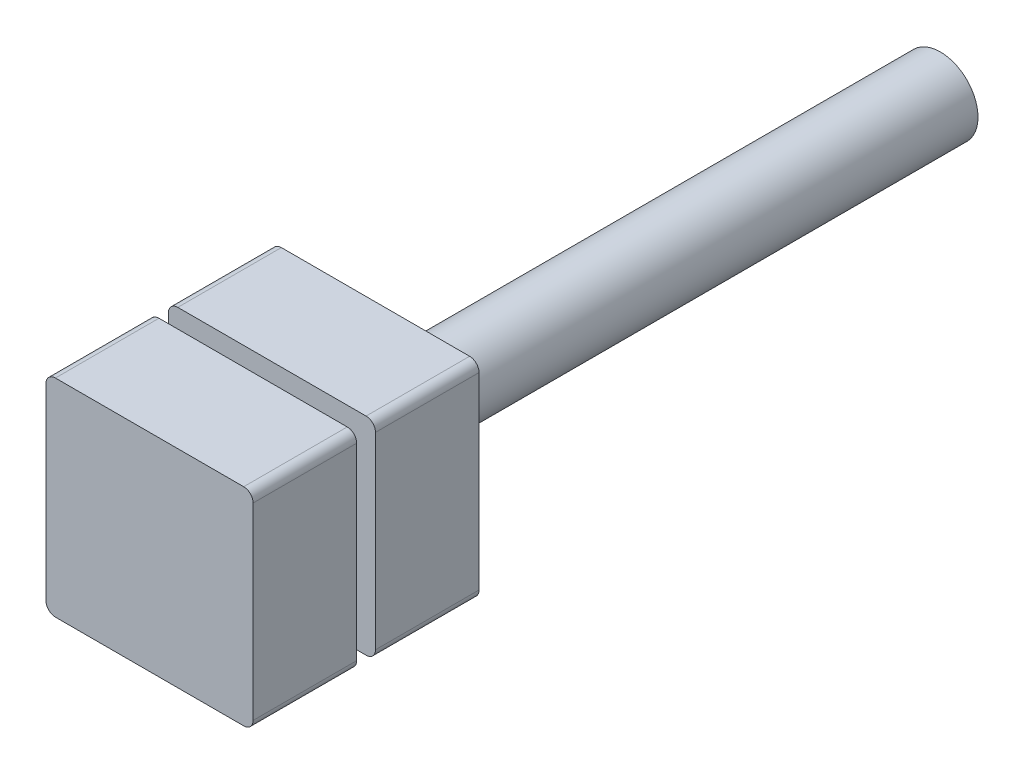
ISO-10303-21;
HEADER;
FILE_DESCRIPTION(('STEP AP214'),'2;1');
FILE_NAME('part.step','',(''),(''),'','','');
FILE_SCHEMA(('AUTOMOTIVE_DESIGN { 1 0 10303 214 1 1 1 1 }'));
ENDSEC;
DATA;
#1=APPLICATION_CONTEXT('core data for automotive mechanical design processes');
#2=APPLICATION_PROTOCOL_DEFINITION('international standard','automotive_design',2000,#1);
#3=PRODUCT_CONTEXT('',#1,'mechanical');
#4=PRODUCT('Part','Part','',(#3));
#5=PRODUCT_RELATED_PRODUCT_CATEGORY('part','',(#4));
#6=PRODUCT_DEFINITION_FORMATION('','',#4);
#7=PRODUCT_DEFINITION_CONTEXT('part definition',#1,'design');
#8=PRODUCT_DEFINITION('design','',#6,#7);
#9=PRODUCT_DEFINITION_SHAPE('','',#8);
#10=(LENGTH_UNIT() NAMED_UNIT(*) SI_UNIT(.MILLI.,.METRE.));
#11=(NAMED_UNIT(*) PLANE_ANGLE_UNIT() SI_UNIT($,.RADIAN.));
#12=(NAMED_UNIT(*) SI_UNIT($,.STERADIAN.) SOLID_ANGLE_UNIT());
#13=UNCERTAINTY_MEASURE_WITH_UNIT(LENGTH_MEASURE(1.E-05),#10,'distance_accuracy_value','');
#14=(GEOMETRIC_REPRESENTATION_CONTEXT(3) GLOBAL_UNCERTAINTY_ASSIGNED_CONTEXT((#13)) GLOBAL_UNIT_ASSIGNED_CONTEXT((#10,
#11,#12)) REPRESENTATION_CONTEXT('',''));
#15=CARTESIAN_POINT('',(0.,0.,0.));
#16=DIRECTION('',(0.,0.,1.));
#17=DIRECTION('',(1.,0.,0.));
#18=AXIS2_PLACEMENT_3D('',#15,#16,#17);
#19=CARTESIAN_POINT('',(-11.,11.,24.));
#20=DIRECTION('',(0.,-1.,0.));
#21=DIRECTION('',(0.,0.,-1.));
#22=AXIS2_PLACEMENT_3D('',#19,#20,#21);
#23=PLANE('',#22);
#24=DIRECTION('',(-1.,0.,0.));
#25=VECTOR('',#24,1.);
#26=CARTESIAN_POINT('',(-11.,11.,0.));
#27=LINE('',#26,#25);
#28=CARTESIAN_POINT('',(10.,11.,0.));
#29=VERTEX_POINT('',#28);
#30=CARTESIAN_POINT('',(-10.,11.,0.));
#31=VERTEX_POINT('',#30);
#32=EDGE_CURVE('E282',#29,#31,#27,.T.);
#33=ORIENTED_EDGE('',*,*,#32,.T.);
#34=DIRECTION('',(0.,0.,-1.));
#35=VECTOR('',#34,1.);
#36=CARTESIAN_POINT('',(-10.,11.,24.));
#37=LINE('',#36,#35);
#38=CARTESIAN_POINT('',(-10.,11.,11.));
#39=VERTEX_POINT('',#38);
#40=EDGE_CURVE('E378',#31,#39,#37,.F.);
#41=ORIENTED_EDGE('',*,*,#40,.T.);
#42=DIRECTION('',(1.,0.,0.));
#43=VECTOR('',#42,1.);
#44=CARTESIAN_POINT('',(8.,11.,11.));
#45=LINE('',#44,#43);
#46=CARTESIAN_POINT('',(10.,11.,11.));
#47=VERTEX_POINT('',#46);
#48=EDGE_CURVE('E241',#39,#47,#45,.T.);
#49=ORIENTED_EDGE('',*,*,#48,.T.);
#50=DIRECTION('',(0.,0.,-1.));
#51=VECTOR('',#50,1.);
#52=CARTESIAN_POINT('',(10.,11.,24.));
#53=LINE('',#52,#51);
#54=EDGE_CURVE('E374',#47,#29,#53,.T.);
#55=ORIENTED_EDGE('',*,*,#54,.T.);
#56=EDGE_LOOP('',(#33,#41,#49,#55));
#57=FACE_BOUND('',#56,.T.);
#58=ADVANCED_FACE('F45',(#57),#23,.F.);
#59=CARTESIAN_POINT('',(-11.,11.,24.));
#60=DIRECTION('',(1.,0.,0.));
#61=DIRECTION('',(0.,1.,0.));
#62=AXIS2_PLACEMENT_3D('',#59,#60,#61);
#63=PLANE('',#62);
#64=DIRECTION('',(0.,-1.,0.));
#65=VECTOR('',#64,1.);
#66=CARTESIAN_POINT('',(-11.,11.,0.));
#67=LINE('',#66,#65);
#68=CARTESIAN_POINT('',(-11.,10.,0.));
#69=VERTEX_POINT('',#68);
#70=CARTESIAN_POINT('',(-11.,-10.,0.));
#71=VERTEX_POINT('',#70);
#72=EDGE_CURVE('E286',#69,#71,#67,.T.);
#73=ORIENTED_EDGE('',*,*,#72,.T.);
#74=DIRECTION('',(0.,0.,-1.));
#75=VECTOR('',#74,1.);
#76=CARTESIAN_POINT('',(-11.,-10.,24.));
#77=LINE('',#76,#75);
#78=CARTESIAN_POINT('',(-11.,-10.,11.));
#79=VERTEX_POINT('',#78);
#80=EDGE_CURVE('E322',#71,#79,#77,.F.);
#81=ORIENTED_EDGE('',*,*,#80,.T.);
#82=DIRECTION('',(0.,1.,0.));
#83=VECTOR('',#82,1.);
#84=CARTESIAN_POINT('',(-11.,7.99999999999996,11.));
#85=LINE('',#84,#83);
#86=CARTESIAN_POINT('',(-11.,10.,11.));
#87=VERTEX_POINT('',#86);
#88=EDGE_CURVE('E225',#79,#87,#85,.T.);
#89=ORIENTED_EDGE('',*,*,#88,.T.);
#90=DIRECTION('',(0.,0.,-1.));
#91=VECTOR('',#90,1.);
#92=CARTESIAN_POINT('',(-11.,10.,24.));
#93=LINE('',#92,#91);
#94=EDGE_CURVE('E318',#87,#69,#93,.T.);
#95=ORIENTED_EDGE('',*,*,#94,.T.);
#96=EDGE_LOOP('',(#73,#81,#89,#95));
#97=FACE_BOUND('',#96,.T.);
#98=ADVANCED_FACE('F421',(#97),#63,.F.);
#99=CARTESIAN_POINT('',(-11.,-11.,24.));
#100=DIRECTION('',(0.,1.,0.));
#101=DIRECTION('',(0.,0.,1.));
#102=AXIS2_PLACEMENT_3D('',#99,#100,#101);
#103=PLANE('',#102);
#104=DIRECTION('',(1.,0.,0.));
#105=VECTOR('',#104,1.);
#106=CARTESIAN_POINT('',(8.,-11.,11.));
#107=LINE('',#106,#105);
#108=CARTESIAN_POINT('',(-9.99999999999999,-11.,11.));
#109=VERTEX_POINT('',#108);
#110=CARTESIAN_POINT('',(10.,-11.,11.));
#111=VERTEX_POINT('',#110);
#112=EDGE_CURVE('E248',#109,#111,#107,.T.);
#113=ORIENTED_EDGE('',*,*,#112,.F.);
#114=DIRECTION('',(0.,0.,-1.));
#115=VECTOR('',#114,1.);
#116=CARTESIAN_POINT('',(-9.99999999999999,-11.,24.));
#117=LINE('',#116,#115);
#118=CARTESIAN_POINT('',(-9.99999999999999,-11.,0.));
#119=VERTEX_POINT('',#118);
#120=EDGE_CURVE('E302',#109,#119,#117,.T.);
#121=ORIENTED_EDGE('',*,*,#120,.T.);
#122=DIRECTION('',(1.,0.,0.));
#123=VECTOR('',#122,1.);
#124=CARTESIAN_POINT('',(-11.,-11.,0.));
#125=LINE('',#124,#123);
#126=CARTESIAN_POINT('',(10.,-11.,0.));
#127=VERTEX_POINT('',#126);
#128=EDGE_CURVE('E268',#119,#127,#125,.T.);
#129=ORIENTED_EDGE('',*,*,#128,.T.);
#130=DIRECTION('',(0.,0.,-1.));
#131=VECTOR('',#130,1.);
#132=CARTESIAN_POINT('',(10.,-11.,24.));
#133=LINE('',#132,#131);
#134=EDGE_CURVE('E299',#127,#111,#133,.F.);
#135=ORIENTED_EDGE('',*,*,#134,.T.);
#136=EDGE_LOOP('',(#113,#121,#129,#135));
#137=FACE_BOUND('',#136,.T.);
#138=ADVANCED_FACE('F429',(#137),#103,.F.);
#139=CARTESIAN_POINT('',(8.,0.,0.));
#140=DIRECTION('',(1.,0.,0.));
#141=DIRECTION('',(0.,1.,0.));
#142=AXIS2_PLACEMENT_3D('',#139,#140,#141);
#143=PLANE('',#142);
#144=DIRECTION('',(0.,1.,0.));
#145=VECTOR('',#144,1.);
#146=CARTESIAN_POINT('',(8.,11.,11.));
#147=LINE('',#146,#145);
#148=CARTESIAN_POINT('',(8.,-7.99999999999991,11.));
#149=VERTEX_POINT('',#148);
#150=CARTESIAN_POINT('',(8.,8.00000000000003,11.));
#151=VERTEX_POINT('',#150);
#152=EDGE_CURVE('E233',#149,#151,#147,.T.);
#153=ORIENTED_EDGE('',*,*,#152,.T.);
#154=DIRECTION('',(0.,0.,1.));
#155=VECTOR('',#154,1.);
#156=CARTESIAN_POINT('',(8.,8.00000000000003,0.));
#157=LINE('',#156,#155);
#158=CARTESIAN_POINT('',(8.,8.00000000000003,13.));
#159=VERTEX_POINT('',#158);
#160=EDGE_CURVE('E295',#151,#159,#157,.T.);
#161=ORIENTED_EDGE('',*,*,#160,.T.);
#162=DIRECTION('',(0.,-1.,0.));
#163=VECTOR('',#162,1.);
#164=CARTESIAN_POINT('',(8.,11.,13.));
#165=LINE('',#164,#163);
#166=CARTESIAN_POINT('',(8.,-7.99999999999992,13.));
#167=VERTEX_POINT('',#166);
#168=EDGE_CURVE('E237',#159,#167,#165,.T.);
#169=ORIENTED_EDGE('',*,*,#168,.T.);
#170=DIRECTION('',(0.,0.,-1.));
#171=VECTOR('',#170,1.);
#172=CARTESIAN_POINT('',(8.,-7.99999999999991,0.));
#173=LINE('',#172,#171);
#174=EDGE_CURVE('E192',#167,#149,#173,.T.);
#175=ORIENTED_EDGE('',*,*,#174,.T.);
#176=EDGE_LOOP('',(#153,#161,#169,#175));
#177=FACE_BOUND('',#176,.T.);
#178=ADVANCED_FACE('F497',(#177),#143,.T.);
#179=CARTESIAN_POINT('',(11.,11.,24.));
#180=DIRECTION('',(-1.,0.,0.));
#181=DIRECTION('',(0.,-1.,0.));
#182=AXIS2_PLACEMENT_3D('',#179,#180,#181);
#183=PLANE('',#182);
#184=DIRECTION('',(0.,1.,0.));
#185=VECTOR('',#184,1.);
#186=CARTESIAN_POINT('',(11.,11.,11.));
#187=LINE('',#186,#185);
#188=CARTESIAN_POINT('',(11.,-10.,11.));
#189=VERTEX_POINT('',#188);
#190=CARTESIAN_POINT('',(11.,10.,11.));
#191=VERTEX_POINT('',#190);
#192=EDGE_CURVE('E232',#189,#191,#187,.T.);
#193=ORIENTED_EDGE('',*,*,#192,.F.);
#194=DIRECTION('',(0.,0.,-1.));
#195=VECTOR('',#194,1.);
#196=CARTESIAN_POINT('',(11.,-10.,24.));
#197=LINE('',#196,#195);
#198=CARTESIAN_POINT('',(11.,-10.,0.));
#199=VERTEX_POINT('',#198);
#200=EDGE_CURVE('E11',#189,#199,#197,.T.);
#201=ORIENTED_EDGE('',*,*,#200,.T.);
#202=DIRECTION('',(0.,1.,0.));
#203=VECTOR('',#202,1.);
#204=CARTESIAN_POINT('',(11.,11.,0.));
#205=LINE('',#204,#203);
#206=CARTESIAN_POINT('',(11.,10.,0.));
#207=VERTEX_POINT('',#206);
#208=EDGE_CURVE('E252',#199,#207,#205,.T.);
#209=ORIENTED_EDGE('',*,*,#208,.T.);
#210=DIRECTION('',(0.,0.,-1.));
#211=VECTOR('',#210,1.);
#212=CARTESIAN_POINT('',(11.,10.,24.));
#213=LINE('',#212,#211);
#214=EDGE_CURVE('E54',#207,#191,#213,.F.);
#215=ORIENTED_EDGE('',*,*,#214,.T.);
#216=EDGE_LOOP('',(#193,#201,#209,#215));
#217=FACE_BOUND('',#216,.T.);
#218=ADVANCED_FACE('F397',(#217),#183,.F.);
#219=DIRECTION('',(0.,1.,0.));
#220=VECTOR('',#219,1.);
#221=CARTESIAN_POINT('',(11.,11.,24.));
#222=LINE('',#221,#220);
#223=CARTESIAN_POINT('',(11.,-10.,24.));
#224=VERTEX_POINT('',#223);
#225=CARTESIAN_POINT('',(11.,10.,24.));
#226=VERTEX_POINT('',#225);
#227=EDGE_CURVE('E264',#224,#226,#222,.T.);
#228=ORIENTED_EDGE('',*,*,#227,.F.);
#229=DIRECTION('',(0.,0.,-1.));
#230=VECTOR('',#229,1.);
#231=CARTESIAN_POINT('',(11.,-10.,24.));
#232=LINE('',#231,#230);
#233=CARTESIAN_POINT('',(11.,-10.,13.));
#234=VERTEX_POINT('',#233);
#235=EDGE_CURVE('E390',#224,#234,#232,.T.);
#236=ORIENTED_EDGE('',*,*,#235,.T.);
#237=DIRECTION('',(0.,-1.,0.));
#238=VECTOR('',#237,1.);
#239=CARTESIAN_POINT('',(11.,11.,13.));
#240=LINE('',#239,#238);
#241=CARTESIAN_POINT('',(11.,10.,13.));
#242=VERTEX_POINT('',#241);
#243=EDGE_CURVE('E238',#242,#234,#240,.T.);
#244=ORIENTED_EDGE('',*,*,#243,.F.);
#245=DIRECTION('',(0.,0.,-1.));
#246=VECTOR('',#245,1.);
#247=CARTESIAN_POINT('',(11.,10.,24.));
#248=LINE('',#247,#246);
#249=EDGE_CURVE('E387',#242,#226,#248,.F.);
#250=ORIENTED_EDGE('',*,*,#249,.T.);
#251=EDGE_LOOP('',(#228,#236,#244,#250));
#252=FACE_BOUND('',#251,.T.);
#253=ADVANCED_FACE('F456',(#252),#183,.F.);
#254=DIRECTION('',(1.,0.,0.));
#255=VECTOR('',#254,1.);
#256=CARTESIAN_POINT('',(8.,11.,13.));
#257=LINE('',#256,#255);
#258=CARTESIAN_POINT('',(-10.,11.,13.));
#259=VERTEX_POINT('',#258);
#260=CARTESIAN_POINT('',(10.,11.,13.));
#261=VERTEX_POINT('',#260);
#262=EDGE_CURVE('E257',#259,#261,#257,.T.);
#263=ORIENTED_EDGE('',*,*,#262,.F.);
#264=DIRECTION('',(0.,0.,-1.));
#265=VECTOR('',#264,1.);
#266=CARTESIAN_POINT('',(-10.,11.,24.));
#267=LINE('',#266,#265);
#268=CARTESIAN_POINT('',(-10.,11.,24.));
#269=VERTEX_POINT('',#268);
#270=EDGE_CURVE('E61',#259,#269,#267,.F.);
#271=ORIENTED_EDGE('',*,*,#270,.T.);
#272=DIRECTION('',(-1.,0.,0.));
#273=VECTOR('',#272,1.);
#274=CARTESIAN_POINT('',(-11.,11.,24.));
#275=LINE('',#274,#273);
#276=CARTESIAN_POINT('',(10.,11.,24.));
#277=VERTEX_POINT('',#276);
#278=EDGE_CURVE('E267',#277,#269,#275,.T.);
#279=ORIENTED_EDGE('',*,*,#278,.F.);
#280=DIRECTION('',(0.,0.,-1.));
#281=VECTOR('',#280,1.);
#282=CARTESIAN_POINT('',(10.,11.,24.));
#283=LINE('',#282,#281);
#284=EDGE_CURVE('E381',#277,#261,#283,.T.);
#285=ORIENTED_EDGE('',*,*,#284,.T.);
#286=EDGE_LOOP('',(#263,#271,#279,#285));
#287=FACE_BOUND('',#286,.T.);
#288=ADVANCED_FACE('F447',(#287),#23,.F.);
#289=DIRECTION('',(0.,1.,0.));
#290=VECTOR('',#289,1.);
#291=CARTESIAN_POINT('',(-11.,7.99999999999996,13.));
#292=LINE('',#291,#290);
#293=CARTESIAN_POINT('',(-11.,-10.,13.));
#294=VERTEX_POINT('',#293);
#295=CARTESIAN_POINT('',(-11.,10.,13.));
#296=VERTEX_POINT('',#295);
#297=EDGE_CURVE('E221',#294,#296,#292,.T.);
#298=ORIENTED_EDGE('',*,*,#297,.F.);
#299=DIRECTION('',(0.,0.,-1.));
#300=VECTOR('',#299,1.);
#301=CARTESIAN_POINT('',(-11.,-10.,24.));
#302=LINE('',#301,#300);
#303=CARTESIAN_POINT('',(-11.,-10.,24.));
#304=VERTEX_POINT('',#303);
#305=EDGE_CURVE('E360',#294,#304,#302,.F.);
#306=ORIENTED_EDGE('',*,*,#305,.T.);
#307=DIRECTION('',(0.,-1.,0.));
#308=VECTOR('',#307,1.);
#309=CARTESIAN_POINT('',(-11.,11.,24.));
#310=LINE('',#309,#308);
#311=CARTESIAN_POINT('',(-11.,10.,24.));
#312=VERTEX_POINT('',#311);
#313=EDGE_CURVE('E271',#312,#304,#310,.T.);
#314=ORIENTED_EDGE('',*,*,#313,.F.);
#315=DIRECTION('',(0.,0.,-1.));
#316=VECTOR('',#315,1.);
#317=CARTESIAN_POINT('',(-11.,10.,24.));
#318=LINE('',#317,#316);
#319=EDGE_CURVE('E356',#312,#296,#318,.T.);
#320=ORIENTED_EDGE('',*,*,#319,.T.);
#321=EDGE_LOOP('',(#298,#306,#314,#320));
#322=FACE_BOUND('',#321,.T.);
#323=ADVANCED_FACE('F453',(#322),#63,.F.);
#324=DIRECTION('',(1.,0.,0.));
#325=VECTOR('',#324,1.);
#326=CARTESIAN_POINT('',(-11.,-11.,24.));
#327=LINE('',#326,#325);
#328=CARTESIAN_POINT('',(-9.99999999999999,-11.,24.));
#329=VERTEX_POINT('',#328);
#330=CARTESIAN_POINT('',(10.,-11.,24.));
#331=VERTEX_POINT('',#330);
#332=EDGE_CURVE('E275',#329,#331,#327,.T.);
#333=ORIENTED_EDGE('',*,*,#332,.F.);
#334=DIRECTION('',(0.,0.,-1.));
#335=VECTOR('',#334,1.);
#336=CARTESIAN_POINT('',(-9.99999999999999,-11.,24.));
#337=LINE('',#336,#335);
#338=CARTESIAN_POINT('',(-9.99999999999999,-11.,13.));
#339=VERTEX_POINT('',#338);
#340=EDGE_CURVE('E340',#329,#339,#337,.T.);
#341=ORIENTED_EDGE('',*,*,#340,.T.);
#342=DIRECTION('',(1.,0.,0.));
#343=VECTOR('',#342,1.);
#344=CARTESIAN_POINT('',(8.,-11.,13.));
#345=LINE('',#344,#343);
#346=CARTESIAN_POINT('',(10.,-11.,13.));
#347=VERTEX_POINT('',#346);
#348=EDGE_CURVE('E253',#339,#347,#345,.T.);
#349=ORIENTED_EDGE('',*,*,#348,.T.);
#350=DIRECTION('',(0.,0.,-1.));
#351=VECTOR('',#350,1.);
#352=CARTESIAN_POINT('',(10.,-11.,24.));
#353=LINE('',#352,#351);
#354=EDGE_CURVE('E337',#347,#331,#353,.F.);
#355=ORIENTED_EDGE('',*,*,#354,.T.);
#356=EDGE_LOOP('',(#333,#341,#349,#355));
#357=FACE_BOUND('',#356,.T.);
#358=ADVANCED_FACE('F461',(#357),#103,.F.);
#359=CARTESIAN_POINT('',(0.,0.,24.));
#360=DIRECTION('',(0.,0.,1.));
#361=DIRECTION('',(1.,0.,0.));
#362=AXIS2_PLACEMENT_3D('',#359,#360,#361);
#363=PLANE('',#362);
#364=ORIENTED_EDGE('',*,*,#313,.T.);
#365=CARTESIAN_POINT('',(-9.99999999999999,-10.,24.));
#366=DIRECTION('',(0.,0.,1.));
#367=DIRECTION('',(1.,0.,0.));
#368=AXIS2_PLACEMENT_3D('',#365,#366,#367);
#369=CIRCLE('',#368,1.);
#370=EDGE_CURVE('E371',#304,#329,#369,.T.);
#371=ORIENTED_EDGE('',*,*,#370,.T.);
#372=ORIENTED_EDGE('',*,*,#332,.T.);
#373=CARTESIAN_POINT('',(10.,-10.,24.));
#374=DIRECTION('',(0.,0.,1.));
#375=DIRECTION('',(1.,0.,0.));
#376=AXIS2_PLACEMENT_3D('',#373,#374,#375);
#377=CIRCLE('',#376,1.);
#378=EDGE_CURVE('E365',#331,#224,#377,.T.);
#379=ORIENTED_EDGE('',*,*,#378,.T.);
#380=ORIENTED_EDGE('',*,*,#227,.T.);
#381=CARTESIAN_POINT('',(10.,10.,24.));
#382=DIRECTION('',(0.,0.,1.));
#383=DIRECTION('',(1.,0.,0.));
#384=AXIS2_PLACEMENT_3D('',#381,#382,#383);
#385=CIRCLE('',#384,1.);
#386=EDGE_CURVE('E68',#226,#277,#385,.T.);
#387=ORIENTED_EDGE('',*,*,#386,.T.);
#388=ORIENTED_EDGE('',*,*,#278,.T.);
#389=CARTESIAN_POINT('',(-10.,10.,24.));
#390=DIRECTION('',(0.,0.,1.));
#391=DIRECTION('',(1.,0.,0.));
#392=AXIS2_PLACEMENT_3D('',#389,#390,#391);
#393=CIRCLE('',#392,1.);
#394=EDGE_CURVE('E368',#269,#312,#393,.T.);
#395=ORIENTED_EDGE('',*,*,#394,.T.);
#396=EDGE_LOOP('',(#364,#371,#372,#379,#380,#387,#388,#395));
#397=FACE_BOUND('',#396,.T.);
#398=ADVANCED_FACE('F469',(#397),#363,.T.);
#399=CARTESIAN_POINT('',(0.,0.,0.));
#400=DIRECTION('',(0.,0.,1.));
#401=DIRECTION('',(1.,0.,0.));
#402=AXIS2_PLACEMENT_3D('',#399,#400,#401);
#403=PLANE('',#402);
#404=CARTESIAN_POINT('',(0.,0.,0.));
#405=DIRECTION('',(0.,0.,1.));
#406=DIRECTION('',(1.,0.,0.));
#407=AXIS2_PLACEMENT_3D('',#404,#405,#406);
#408=CIRCLE('',#407,4.);
#409=CARTESIAN_POINT('',(4.,0.,0.));
#410=VERTEX_POINT('',#409);
#411=EDGE_CURVE('E522',#410,#410,#408,.T.);
#412=ORIENTED_EDGE('',*,*,#411,.T.);
#413=EDGE_LOOP('',(#412));
#414=FACE_BOUND('',#413,.T.);
#415=ORIENTED_EDGE('',*,*,#128,.F.);
#416=CARTESIAN_POINT('',(-9.99999999999999,-10.,0.));
#417=DIRECTION('',(0.,0.,1.));
#418=DIRECTION('',(1.,0.,0.));
#419=AXIS2_PLACEMENT_3D('',#416,#417,#418);
#420=CIRCLE('',#419,1.);
#421=EDGE_CURVE('E315',#119,#71,#420,.F.);
#422=ORIENTED_EDGE('',*,*,#421,.T.);
#423=ORIENTED_EDGE('',*,*,#72,.F.);
#424=CARTESIAN_POINT('',(-10.,10.,0.));
#425=DIRECTION('',(0.,0.,1.));
#426=DIRECTION('',(1.,0.,0.));
#427=AXIS2_PLACEMENT_3D('',#424,#425,#426);
#428=CIRCLE('',#427,1.);
#429=EDGE_CURVE('E312',#69,#31,#428,.F.);
#430=ORIENTED_EDGE('',*,*,#429,.T.);
#431=ORIENTED_EDGE('',*,*,#32,.F.);
#432=CARTESIAN_POINT('',(10.,10.,0.));
#433=DIRECTION('',(0.,0.,1.));
#434=DIRECTION('',(1.,0.,0.));
#435=AXIS2_PLACEMENT_3D('',#432,#433,#434);
#436=CIRCLE('',#435,1.);
#437=EDGE_CURVE('E306',#29,#207,#436,.F.);
#438=ORIENTED_EDGE('',*,*,#437,.T.);
#439=ORIENTED_EDGE('',*,*,#208,.F.);
#440=CARTESIAN_POINT('',(10.,-10.,0.));
#441=DIRECTION('',(0.,0.,1.));
#442=DIRECTION('',(1.,0.,0.));
#443=AXIS2_PLACEMENT_3D('',#440,#441,#442);
#444=CIRCLE('',#443,1.);
#445=EDGE_CURVE('E309',#199,#127,#444,.F.);
#446=ORIENTED_EDGE('',*,*,#445,.T.);
#447=EDGE_LOOP('',(#415,#422,#423,#430,#431,#438,#439,#446));
#448=FACE_BOUND('',#447,.T.);
#449=ADVANCED_FACE('F414',(#414,#448),#403,.F.);
#450=CARTESIAN_POINT('',(8.,11.,11.));
#451=DIRECTION('',(0.,0.,-1.));
#452=DIRECTION('',(0.,1.,0.));
#453=AXIS2_PLACEMENT_3D('',#450,#451,#452);
#454=PLANE('',#453);
#455=ORIENTED_EDGE('',*,*,#88,.F.);
#456=CARTESIAN_POINT('',(-9.99999999999999,-10.,11.));
#457=DIRECTION('',(0.,0.,-1.));
#458=DIRECTION('',(0.,1.,0.));
#459=AXIS2_PLACEMENT_3D('',#456,#457,#458);
#460=CIRCLE('',#459,1.);
#461=EDGE_CURVE('E334',#79,#109,#460,.F.);
#462=ORIENTED_EDGE('',*,*,#461,.T.);
#463=ORIENTED_EDGE('',*,*,#112,.T.);
#464=CARTESIAN_POINT('',(10.,-10.,11.));
#465=DIRECTION('',(0.,0.,-1.));
#466=DIRECTION('',(0.,1.,0.));
#467=AXIS2_PLACEMENT_3D('',#464,#465,#466);
#468=CIRCLE('',#467,1.);
#469=EDGE_CURVE('E328',#111,#189,#468,.F.);
#470=ORIENTED_EDGE('',*,*,#469,.T.);
#471=ORIENTED_EDGE('',*,*,#192,.T.);
#472=CARTESIAN_POINT('',(10.,10.,11.));
#473=DIRECTION('',(0.,0.,-1.));
#474=DIRECTION('',(0.,1.,0.));
#475=AXIS2_PLACEMENT_3D('',#472,#473,#474);
#476=CIRCLE('',#475,1.);
#477=EDGE_CURVE('E325',#191,#47,#476,.F.);
#478=ORIENTED_EDGE('',*,*,#477,.T.);
#479=ORIENTED_EDGE('',*,*,#48,.F.);
#480=CARTESIAN_POINT('',(-10.,10.,11.));
#481=DIRECTION('',(0.,0.,-1.));
#482=DIRECTION('',(0.,1.,0.));
#483=AXIS2_PLACEMENT_3D('',#480,#481,#482);
#484=CIRCLE('',#483,1.);
#485=EDGE_CURVE('E331',#39,#87,#484,.F.);
#486=ORIENTED_EDGE('',*,*,#485,.T.);
#487=EDGE_LOOP('',(#455,#462,#463,#470,#471,#478,#479,#486));
#488=FACE_BOUND('',#487,.T.);
#489=DIRECTION('',(-1.,0.,0.));
#490=VECTOR('',#489,1.);
#491=CARTESIAN_POINT('',(-11.,7.99999999999996,11.));
#492=LINE('',#491,#490);
#493=CARTESIAN_POINT('',(-8.,8.,11.));
#494=VERTEX_POINT('',#493);
#495=EDGE_CURVE('E213',#151,#494,#492,.T.);
#496=ORIENTED_EDGE('',*,*,#495,.F.);
#497=ORIENTED_EDGE('',*,*,#152,.F.);
#498=DIRECTION('',(1.,0.,0.));
#499=VECTOR('',#498,1.);
#500=CARTESIAN_POINT('',(11.0000000000001,-7.99999999999989,11.));
#501=LINE('',#500,#499);
#502=CARTESIAN_POINT('',(-8.,-8.00000000000009,11.));
#503=VERTEX_POINT('',#502);
#504=EDGE_CURVE('E198',#503,#149,#501,.T.);
#505=ORIENTED_EDGE('',*,*,#504,.F.);
#506=DIRECTION('',(0.,-1.,0.));
#507=VECTOR('',#506,1.);
#508=CARTESIAN_POINT('',(-8.,-11.,11.));
#509=LINE('',#508,#507);
#510=EDGE_CURVE('E197',#494,#503,#509,.T.);
#511=ORIENTED_EDGE('',*,*,#510,.F.);
#512=EDGE_LOOP('',(#496,#497,#505,#511));
#513=FACE_BOUND('',#512,.T.);
#514=ADVANCED_FACE('F404',(#488,#513),#454,.F.);
#515=CARTESIAN_POINT('',(8.,11.,13.));
#516=DIRECTION('',(0.,0.,1.));
#517=DIRECTION('',(0.,-1.,0.));
#518=AXIS2_PLACEMENT_3D('',#515,#516,#517);
#519=PLANE('',#518);
#520=ORIENTED_EDGE('',*,*,#168,.F.);
#521=DIRECTION('',(1.,0.,0.));
#522=VECTOR('',#521,1.);
#523=CARTESIAN_POINT('',(-11.,7.99999999999996,13.));
#524=LINE('',#523,#522);
#525=CARTESIAN_POINT('',(-8.,7.99999999999997,13.));
#526=VERTEX_POINT('',#525);
#527=EDGE_CURVE('E204',#526,#159,#524,.T.);
#528=ORIENTED_EDGE('',*,*,#527,.F.);
#529=DIRECTION('',(0.,1.,0.));
#530=VECTOR('',#529,1.);
#531=CARTESIAN_POINT('',(-8.,-11.,13.));
#532=LINE('',#531,#530);
#533=CARTESIAN_POINT('',(-8.,-8.00000000000009,13.));
#534=VERTEX_POINT('',#533);
#535=EDGE_CURVE('E201',#534,#526,#532,.T.);
#536=ORIENTED_EDGE('',*,*,#535,.F.);
#537=DIRECTION('',(-1.,0.,0.));
#538=VECTOR('',#537,1.);
#539=CARTESIAN_POINT('',(11.0000000000001,-7.99999999999989,13.));
#540=LINE('',#539,#538);
#541=EDGE_CURVE('E185',#167,#534,#540,.T.);
#542=ORIENTED_EDGE('',*,*,#541,.F.);
#543=EDGE_LOOP('',(#520,#528,#536,#542));
#544=FACE_BOUND('',#543,.T.);
#545=ORIENTED_EDGE('',*,*,#348,.F.);
#546=CARTESIAN_POINT('',(-9.99999999999999,-10.,13.));
#547=DIRECTION('',(0.,0.,1.));
#548=DIRECTION('',(0.,-1.,0.));
#549=AXIS2_PLACEMENT_3D('',#546,#547,#548);
#550=CIRCLE('',#549,1.);
#551=EDGE_CURVE('E353',#339,#294,#550,.F.);
#552=ORIENTED_EDGE('',*,*,#551,.T.);
#553=ORIENTED_EDGE('',*,*,#297,.T.);
#554=CARTESIAN_POINT('',(-10.,10.,13.));
#555=DIRECTION('',(0.,0.,1.));
#556=DIRECTION('',(0.,-1.,0.));
#557=AXIS2_PLACEMENT_3D('',#554,#555,#556);
#558=CIRCLE('',#557,1.);
#559=EDGE_CURVE('E350',#296,#259,#558,.F.);
#560=ORIENTED_EDGE('',*,*,#559,.T.);
#561=ORIENTED_EDGE('',*,*,#262,.T.);
#562=CARTESIAN_POINT('',(10.,10.,13.));
#563=DIRECTION('',(0.,0.,1.));
#564=DIRECTION('',(0.,-1.,0.));
#565=AXIS2_PLACEMENT_3D('',#562,#563,#564);
#566=CIRCLE('',#565,1.);
#567=EDGE_CURVE('E344',#261,#242,#566,.F.);
#568=ORIENTED_EDGE('',*,*,#567,.T.);
#569=ORIENTED_EDGE('',*,*,#243,.T.);
#570=CARTESIAN_POINT('',(10.,-10.,13.));
#571=DIRECTION('',(0.,0.,1.));
#572=DIRECTION('',(0.,-1.,0.));
#573=AXIS2_PLACEMENT_3D('',#570,#571,#572);
#574=CIRCLE('',#573,1.);
#575=EDGE_CURVE('E347',#234,#347,#574,.F.);
#576=ORIENTED_EDGE('',*,*,#575,.T.);
#577=EDGE_LOOP('',(#545,#552,#553,#560,#561,#568,#569,#576));
#578=FACE_BOUND('',#577,.T.);
#579=ADVANCED_FACE('F202',(#544,#578),#519,.F.);
#580=CARTESIAN_POINT('',(0.,8.,0.));
#581=DIRECTION('',(0.,1.,0.));
#582=DIRECTION('',(-1.,0.,0.));
#583=AXIS2_PLACEMENT_3D('',#580,#581,#582);
#584=PLANE('',#583);
#585=ORIENTED_EDGE('',*,*,#495,.T.);
#586=DIRECTION('',(0.,0.,1.));
#587=VECTOR('',#586,1.);
#588=CARTESIAN_POINT('',(-8.,7.99999999999997,0.));
#589=LINE('',#588,#587);
#590=EDGE_CURVE('E229',#494,#526,#589,.T.);
#591=ORIENTED_EDGE('',*,*,#590,.T.);
#592=ORIENTED_EDGE('',*,*,#527,.T.);
#593=ORIENTED_EDGE('',*,*,#160,.F.);
#594=EDGE_LOOP('',(#585,#591,#592,#593));
#595=FACE_BOUND('',#594,.T.);
#596=ADVANCED_FACE('F486',(#595),#584,.T.);
#597=CARTESIAN_POINT('',(-8.,0.,0.));
#598=DIRECTION('',(-1.,0.,0.));
#599=DIRECTION('',(0.,-1.,0.));
#600=AXIS2_PLACEMENT_3D('',#597,#598,#599);
#601=PLANE('',#600);
#602=ORIENTED_EDGE('',*,*,#510,.T.);
#603=DIRECTION('',(0.,0.,1.));
#604=VECTOR('',#603,1.);
#605=CARTESIAN_POINT('',(-8.,-8.00000000000009,0.));
#606=LINE('',#605,#604);
#607=EDGE_CURVE('E189',#503,#534,#606,.T.);
#608=ORIENTED_EDGE('',*,*,#607,.T.);
#609=ORIENTED_EDGE('',*,*,#535,.T.);
#610=ORIENTED_EDGE('',*,*,#590,.F.);
#611=EDGE_LOOP('',(#602,#608,#609,#610));
#612=FACE_BOUND('',#611,.T.);
#613=ADVANCED_FACE('F210',(#612),#601,.T.);
#614=CARTESIAN_POINT('',(0.,-8.,0.));
#615=DIRECTION('',(0.,-1.,0.));
#616=DIRECTION('',(1.,0.,0.));
#617=AXIS2_PLACEMENT_3D('',#614,#615,#616);
#618=PLANE('',#617);
#619=ORIENTED_EDGE('',*,*,#541,.T.);
#620=ORIENTED_EDGE('',*,*,#607,.F.);
#621=ORIENTED_EDGE('',*,*,#504,.T.);
#622=ORIENTED_EDGE('',*,*,#174,.F.);
#623=EDGE_LOOP('',(#619,#620,#621,#622));
#624=FACE_BOUND('',#623,.T.);
#625=ADVANCED_FACE('F187',(#624),#618,.T.);
#626=CARTESIAN_POINT('',(-9.99999999999999,-10.,24.));
#627=DIRECTION('',(0.,0.,-1.));
#628=DIRECTION('',(-1.,0.,0.));
#629=AXIS2_PLACEMENT_3D('',#626,#627,#628);
#630=CYLINDRICAL_SURFACE('',#629,1.);
#631=ORIENTED_EDGE('',*,*,#461,.F.);
#632=ORIENTED_EDGE('',*,*,#80,.F.);
#633=ORIENTED_EDGE('',*,*,#421,.F.);
#634=ORIENTED_EDGE('',*,*,#120,.F.);
#635=EDGE_LOOP('',(#631,#632,#633,#634));
#636=FACE_BOUND('',#635,.T.);
#637=ADVANCED_FACE('F427',(#636),#630,.T.);
#638=CARTESIAN_POINT('',(-9.99999999999999,-10.,24.));
#639=DIRECTION('',(0.,0.,-1.));
#640=DIRECTION('',(-1.,0.,0.));
#641=AXIS2_PLACEMENT_3D('',#638,#639,#640);
#642=CYLINDRICAL_SURFACE('',#641,1.);
#643=ORIENTED_EDGE('',*,*,#370,.F.);
#644=ORIENTED_EDGE('',*,*,#305,.F.);
#645=ORIENTED_EDGE('',*,*,#551,.F.);
#646=ORIENTED_EDGE('',*,*,#340,.F.);
#647=EDGE_LOOP('',(#643,#644,#645,#646));
#648=FACE_BOUND('',#647,.T.);
#649=ADVANCED_FACE('F474',(#648),#642,.T.);
#650=CARTESIAN_POINT('',(-10.,10.,24.));
#651=DIRECTION('',(0.,0.,-1.));
#652=DIRECTION('',(-1.,0.,0.));
#653=AXIS2_PLACEMENT_3D('',#650,#651,#652);
#654=CYLINDRICAL_SURFACE('',#653,1.);
#655=ORIENTED_EDGE('',*,*,#485,.F.);
#656=ORIENTED_EDGE('',*,*,#40,.F.);
#657=ORIENTED_EDGE('',*,*,#429,.F.);
#658=ORIENTED_EDGE('',*,*,#94,.F.);
#659=EDGE_LOOP('',(#655,#656,#657,#658));
#660=FACE_BOUND('',#659,.T.);
#661=ADVANCED_FACE('F419',(#660),#654,.T.);
#662=CARTESIAN_POINT('',(-10.,10.,24.));
#663=DIRECTION('',(0.,0.,-1.));
#664=DIRECTION('',(-1.,0.,0.));
#665=AXIS2_PLACEMENT_3D('',#662,#663,#664);
#666=CYLINDRICAL_SURFACE('',#665,1.);
#667=ORIENTED_EDGE('',*,*,#394,.F.);
#668=ORIENTED_EDGE('',*,*,#270,.F.);
#669=ORIENTED_EDGE('',*,*,#559,.F.);
#670=ORIENTED_EDGE('',*,*,#319,.F.);
#671=EDGE_LOOP('',(#667,#668,#669,#670));
#672=FACE_BOUND('',#671,.T.);
#673=ADVANCED_FACE('F442',(#672),#666,.T.);
#674=CARTESIAN_POINT('',(10.,-10.,24.));
#675=DIRECTION('',(0.,0.,-1.));
#676=DIRECTION('',(-1.,0.,0.));
#677=AXIS2_PLACEMENT_3D('',#674,#675,#676);
#678=CYLINDRICAL_SURFACE('',#677,1.);
#679=ORIENTED_EDGE('',*,*,#378,.F.);
#680=ORIENTED_EDGE('',*,*,#354,.F.);
#681=ORIENTED_EDGE('',*,*,#575,.F.);
#682=ORIENTED_EDGE('',*,*,#235,.F.);
#683=EDGE_LOOP('',(#679,#680,#681,#682));
#684=FACE_BOUND('',#683,.T.);
#685=ADVANCED_FACE('F435',(#684),#678,.T.);
#686=CARTESIAN_POINT('',(10.,-10.,24.));
#687=DIRECTION('',(0.,0.,-1.));
#688=DIRECTION('',(-1.,0.,0.));
#689=AXIS2_PLACEMENT_3D('',#686,#687,#688);
#690=CYLINDRICAL_SURFACE('',#689,1.);
#691=ORIENTED_EDGE('',*,*,#469,.F.);
#692=ORIENTED_EDGE('',*,*,#134,.F.);
#693=ORIENTED_EDGE('',*,*,#445,.F.);
#694=ORIENTED_EDGE('',*,*,#200,.F.);
#695=EDGE_LOOP('',(#691,#692,#693,#694));
#696=FACE_BOUND('',#695,.T.);
#697=ADVANCED_FACE('F432',(#696),#690,.T.);
#698=CARTESIAN_POINT('',(10.,10.,24.));
#699=DIRECTION('',(0.,0.,-1.));
#700=DIRECTION('',(-1.,0.,0.));
#701=AXIS2_PLACEMENT_3D('',#698,#699,#700);
#702=CYLINDRICAL_SURFACE('',#701,1.);
#703=ORIENTED_EDGE('',*,*,#386,.F.);
#704=ORIENTED_EDGE('',*,*,#249,.F.);
#705=ORIENTED_EDGE('',*,*,#567,.F.);
#706=ORIENTED_EDGE('',*,*,#284,.F.);
#707=EDGE_LOOP('',(#703,#704,#705,#706));
#708=FACE_BOUND('',#707,.T.);
#709=ADVANCED_FACE('F434',(#708),#702,.T.);
#710=CARTESIAN_POINT('',(10.,10.,24.));
#711=DIRECTION('',(0.,0.,-1.));
#712=DIRECTION('',(-1.,0.,0.));
#713=AXIS2_PLACEMENT_3D('',#710,#711,#712);
#714=CYLINDRICAL_SURFACE('',#713,1.);
#715=ORIENTED_EDGE('',*,*,#477,.F.);
#716=ORIENTED_EDGE('',*,*,#214,.F.);
#717=ORIENTED_EDGE('',*,*,#437,.F.);
#718=ORIENTED_EDGE('',*,*,#54,.F.);
#719=EDGE_LOOP('',(#715,#716,#717,#718));
#720=FACE_BOUND('',#719,.T.);
#721=ADVANCED_FACE('F47',(#720),#714,.T.);
#722=CARTESIAN_POINT('',(0.,0.,-60.));
#723=DIRECTION('',(0.,0.,1.));
#724=DIRECTION('',(1.,0.,0.));
#725=AXIS2_PLACEMENT_3D('',#722,#723,#724);
#726=CYLINDRICAL_SURFACE('',#725,4.);
#727=CARTESIAN_POINT('',(0.,0.,-60.));
#728=DIRECTION('',(0.,0.,1.));
#729=DIRECTION('',(1.,0.,0.));
#730=AXIS2_PLACEMENT_3D('',#727,#728,#729);
#731=CIRCLE('',#730,4.);
#732=CARTESIAN_POINT('',(4.,0.,-60.));
#733=VERTEX_POINT('',#732);
#734=EDGE_CURVE('E521',#733,#733,#731,.T.);
#735=ORIENTED_EDGE('',*,*,#734,.T.);
#736=EDGE_LOOP('',(#735));
#737=FACE_BOUND('',#736,.T.);
#738=ORIENTED_EDGE('',*,*,#411,.F.);
#739=EDGE_LOOP('',(#738));
#740=FACE_BOUND('',#739,.T.);
#741=ADVANCED_FACE('F530',(#737,#740),#726,.T.);
#742=CARTESIAN_POINT('',(0.,0.,-60.));
#743=DIRECTION('',(0.,0.,1.));
#744=DIRECTION('',(1.,0.,0.));
#745=AXIS2_PLACEMENT_3D('',#742,#743,#744);
#746=PLANE('',#745);
#747=ORIENTED_EDGE('',*,*,#734,.F.);
#748=EDGE_LOOP('',(#747));
#749=FACE_BOUND('',#748,.T.);
#750=ADVANCED_FACE('F533',(#749),#746,.F.);
#751=CLOSED_SHELL('',(#58,#98,#138,#178,#218,#253,#288,#323,#358,#398,#449,#514,#579,#596,#613,
#625,#637,#649,#661,#673,#685,#697,#709,#721,#741,#750));
#752=MANIFOLD_SOLID_BREP('B2',#751);
#753=ADVANCED_BREP_SHAPE_REPRESENTATION('',(#18,#752),#14);
#754=SHAPE_DEFINITION_REPRESENTATION(#9,#753);
ENDSEC;
END-ISO-10303-21;
